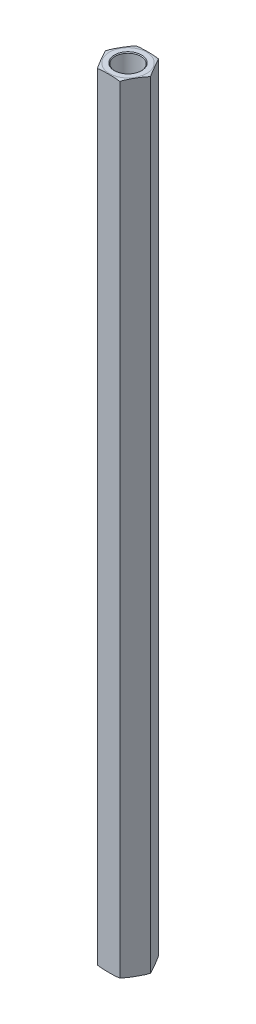
ISO-10303-21;
HEADER;
FILE_DESCRIPTION(('STEP AP214'),'2;1');
FILE_NAME('part.step','',(''),(''),'','','');
FILE_SCHEMA(('AUTOMOTIVE_DESIGN { 1 0 10303 214 1 1 1 1 }'));
ENDSEC;
DATA;
#1=APPLICATION_CONTEXT('core data for automotive mechanical design processes');
#2=APPLICATION_PROTOCOL_DEFINITION('international standard','automotive_design',2000,#1);
#3=PRODUCT_CONTEXT('',#1,'mechanical');
#4=PRODUCT('Part','Part','',(#3));
#5=PRODUCT_RELATED_PRODUCT_CATEGORY('part','',(#4));
#6=PRODUCT_DEFINITION_FORMATION('','',#4);
#7=PRODUCT_DEFINITION_CONTEXT('part definition',#1,'design');
#8=PRODUCT_DEFINITION('design','',#6,#7);
#9=PRODUCT_DEFINITION_SHAPE('','',#8);
#10=(LENGTH_UNIT() NAMED_UNIT(*) SI_UNIT(.MILLI.,.METRE.));
#11=(NAMED_UNIT(*) PLANE_ANGLE_UNIT() SI_UNIT($,.RADIAN.));
#12=(NAMED_UNIT(*) SI_UNIT($,.STERADIAN.) SOLID_ANGLE_UNIT());
#13=UNCERTAINTY_MEASURE_WITH_UNIT(LENGTH_MEASURE(1.E-05),#10,'distance_accuracy_value','');
#14=(GEOMETRIC_REPRESENTATION_CONTEXT(3) GLOBAL_UNCERTAINTY_ASSIGNED_CONTEXT((#13)) GLOBAL_UNIT_ASSIGNED_CONTEXT((#10,
#11,#12)) REPRESENTATION_CONTEXT('',''));
#15=CARTESIAN_POINT('',(0.,0.,0.));
#16=DIRECTION('',(0.,0.,1.));
#17=DIRECTION('',(1.,0.,0.));
#18=AXIS2_PLACEMENT_3D('',#15,#16,#17);
#19=CARTESIAN_POINT('',(0.,50.8,0.));
#20=DIRECTION('',(0.,1.,0.));
#21=DIRECTION('',(0.,0.,1.));
#22=AXIS2_PLACEMENT_3D('',#19,#20,#21);
#23=PLANE('',#22);
#24=CARTESIAN_POINT('',(0.,50.8,0.));
#25=DIRECTION('',(0.,1.,0.));
#26=DIRECTION('',(0.,0.,1.));
#27=AXIS2_PLACEMENT_3D('',#24,#25,#26);
#28=CIRCLE('',#27,2.0955);
#29=CARTESIAN_POINT('',(0.,50.8,2.0955));
#30=VERTEX_POINT('',#29);
#31=EDGE_CURVE('E302',#30,#30,#28,.T.);
#32=ORIENTED_EDGE('',*,*,#31,.T.);
#33=EDGE_LOOP('',(#32));
#34=FACE_BOUND('',#33,.T.);
#35=ADVANCED_FACE('F16',(#34),#23,.T.);
#36=CARTESIAN_POINT('',(0.,-50.8,0.));
#37=DIRECTION('',(0.,-1.,0.));
#38=DIRECTION('',(0.,0.,-1.));
#39=AXIS2_PLACEMENT_3D('',#36,#37,#38);
#40=PLANE('',#39);
#41=CARTESIAN_POINT('',(0.,-50.8,0.));
#42=DIRECTION('',(0.,-1.,0.));
#43=DIRECTION('',(0.,0.,-1.));
#44=AXIS2_PLACEMENT_3D('',#41,#42,#43);
#45=CIRCLE('',#44,2.0955);
#46=CARTESIAN_POINT('',(0.,-50.8,-2.0955));
#47=VERTEX_POINT('',#46);
#48=EDGE_CURVE('E415',#47,#47,#45,.T.);
#49=ORIENTED_EDGE('',*,*,#48,.T.);
#50=EDGE_LOOP('',(#49));
#51=FACE_BOUND('',#50,.T.);
#52=ADVANCED_FACE('F397',(#51),#40,.T.);
#53=CARTESIAN_POINT('',(0.,50.8,0.));
#54=DIRECTION('',(0.,1.,0.));
#55=DIRECTION('',(0.,0.,1.));
#56=AXIS2_PLACEMENT_3D('',#53,#54,#55);
#57=CYLINDRICAL_SURFACE('',#56,2.0955);
#58=CARTESIAN_POINT('',(0.,63.3729999999559,0.));
#59=DIRECTION('',(0.,1.,0.));
#60=DIRECTION('',(0.,0.,1.));
#61=AXIS2_PLACEMENT_3D('',#58,#59,#60);
#62=CIRCLE('',#61,2.09549999993897);
#63=CARTESIAN_POINT('',(0.,63.3729999999559,2.09549999993897));
#64=VERTEX_POINT('',#63);
#65=EDGE_CURVE('E417',#64,#64,#62,.T.);
#66=ORIENTED_EDGE('',*,*,#65,.T.);
#67=EDGE_LOOP('',(#66));
#68=FACE_BOUND('',#67,.T.);
#69=ORIENTED_EDGE('',*,*,#31,.F.);
#70=EDGE_LOOP('',(#69));
#71=FACE_BOUND('',#70,.T.);
#72=ADVANCED_FACE('F389',(#68,#71),#57,.F.);
#73=CARTESIAN_POINT('',(0.,-50.8,0.));
#74=DIRECTION('',(0.,-1.,0.));
#75=DIRECTION('',(0.,0.,-1.));
#76=AXIS2_PLACEMENT_3D('',#73,#74,#75);
#77=CYLINDRICAL_SURFACE('',#76,2.0955);
#78=ORIENTED_EDGE('',*,*,#48,.F.);
#79=EDGE_LOOP('',(#78));
#80=FACE_BOUND('',#79,.T.);
#81=CARTESIAN_POINT('',(0.,-63.3730000000128,0.));
#82=DIRECTION('',(0.,-1.,0.));
#83=DIRECTION('',(0.,0.,-1.));
#84=AXIS2_PLACEMENT_3D('',#81,#82,#83);
#85=CIRCLE('',#84,2.09550000005265);
#86=CARTESIAN_POINT('',(0.,-63.3730000000128,-2.09550000005265));
#87=VERTEX_POINT('',#86);
#88=EDGE_CURVE('E155',#87,#87,#85,.T.);
#89=ORIENTED_EDGE('',*,*,#88,.T.);
#90=EDGE_LOOP('',(#89));
#91=FACE_BOUND('',#90,.T.);
#92=ADVANCED_FACE('F381',(#80,#91),#77,.F.);
#93=CARTESIAN_POINT('',(0.,63.4999999999764,0.));
#94=DIRECTION('',(0.,1.,0.));
#95=DIRECTION('',(0.,0.,1.));
#96=AXIS2_PLACEMENT_3D('',#93,#94,#95);
#97=CONICAL_SURFACE('',#96,2.22249999995938,0.785398163397448);
#98=CARTESIAN_POINT('',(0.,63.5000000000332,0.));
#99=DIRECTION('',(0.,1.,0.));
#100=DIRECTION('',(0.,0.,1.));
#101=AXIS2_PLACEMENT_3D('',#98,#99,#100);
#102=CIRCLE('',#101,2.22250000001623);
#103=CARTESIAN_POINT('',(0.,63.5000000000332,2.22250000001623));
#104=VERTEX_POINT('',#103);
#105=EDGE_CURVE('E299',#104,#104,#102,.T.);
#106=ORIENTED_EDGE('',*,*,#105,.T.);
#107=EDGE_LOOP('',(#106));
#108=FACE_BOUND('',#107,.T.);
#109=ORIENTED_EDGE('',*,*,#65,.F.);
#110=EDGE_LOOP('',(#109));
#111=FACE_BOUND('',#110,.T.);
#112=ADVANCED_FACE('F322',(#108,#111),#97,.F.);
#113=CARTESIAN_POINT('',(3.66617420935412,63.5,0.));
#114=DIRECTION('',(-0.866025403784439,0.,0.5));
#115=DIRECTION('',(0.5,0.,0.866025403784439));
#116=AXIS2_PLACEMENT_3D('',#113,#114,#115);
#117=PLANE('',#116);
#118=DIRECTION('',(0.,1.,0.));
#119=VECTOR('',#118,1.);
#120=CARTESIAN_POINT('',(1.83308710467706,63.5,-3.175));
#121=LINE('',#120,#119);
#122=CARTESIAN_POINT('',(1.83308710467706,-63.373,-3.175));
#123=VERTEX_POINT('',#122);
#124=CARTESIAN_POINT('',(1.83308710467706,63.373,-3.175));
#125=VERTEX_POINT('',#124);
#126=EDGE_CURVE('E78',#123,#125,#121,.T.);
#127=ORIENTED_EDGE('',*,*,#126,.T.);
#128=CARTESIAN_POINT('',(3.66617420935412,63.373,0.));
#129=CARTESIAN_POINT('',(3.62797961467394,63.3889014148997,-0.0661549785605575));
#130=CARTESIAN_POINT('',(3.58956810864157,63.4024886076105,-0.132685658603875));
#131=CARTESIAN_POINT('',(3.51249051795711,63.4258161979402,-0.266187961794358));
#132=CARTESIAN_POINT('',(3.47382473049846,63.4355604771397,-0.333159070187389));
#133=CARTESIAN_POINT('',(3.39641631867873,63.4519966530451,-0.46723437239238));
#134=CARTESIAN_POINT('',(3.35767399633312,63.4586945328669,-0.534338043098183));
#135=CARTESIAN_POINT('',(3.28009834620113,63.4697767572932,-0.66870301055698));
#136=CARTESIAN_POINT('',(3.24126499587771,63.474160450474,-0.735964346345267));
#137=CARTESIAN_POINT('',(3.16354065964315,63.4812403004263,-0.870586845688097));
#138=CARTESIAN_POINT('',(3.12464965374476,63.4839355237591,-0.937948043861568));
#139=CARTESIAN_POINT('',(3.04685144594593,63.4881531983714,-1.07269849250694));
#140=CARTESIAN_POINT('',(3.00794424351969,63.4896756080272,-1.14008774388955));
#141=CARTESIAN_POINT('',(2.93051517598873,63.491922705889,-1.27419882283586));
#142=CARTESIAN_POINT('',(2.89199336248934,63.4926552468181,-1.34092056101649));
#143=CARTESIAN_POINT('',(2.81494778346144,63.4935767302574,-1.47436741839139));
#144=CARTESIAN_POINT('',(2.77642401791439,63.4937656658949,-1.54109253761774));
#145=CARTESIAN_POINT('',(2.69935964431012,63.4936659966806,-1.6745719481538));
#146=CARTESIAN_POINT('',(2.66081903631821,63.4933771811766,-1.74132623935039));
#147=CARTESIAN_POINT('',(2.5837390808533,63.492221986219,-1.87483263846077));
#148=CARTESIAN_POINT('',(2.54519973341245,63.4913555970386,-1.94158474631886));
#149=CARTESIAN_POINT('',(2.46812969629771,63.4887861940656,-2.07507396634282));
#150=CARTESIAN_POINT('',(2.42959900625965,63.4870832271616,-2.14181107913942));
#151=CARTESIAN_POINT('',(2.35255651340908,63.4824387229726,-2.27525259109836));
#152=CARTESIAN_POINT('',(2.31404470975443,63.4794972471358,-2.34195699171935));
#153=CARTESIAN_POINT('',(2.25084206239945,63.4732174124749,-2.45142718811103));
#154=CARTESIAN_POINT('',(2.2261384933701,63.4703980110463,-2.49421502479815));
#155=CARTESIAN_POINT('',(2.17676945272228,63.4638696794304,-2.57972471152111));
#156=CARTESIAN_POINT('',(2.15210397034183,63.4601610809139,-2.62244658019723));
#157=CARTESIAN_POINT('',(2.10282753811696,63.4516802711497,-2.70779586442644));
#158=CARTESIAN_POINT('',(2.07821657107529,63.4469084657008,-2.75042330976602));
#159=CARTESIAN_POINT('',(2.02900094683549,63.4360987712516,-2.83566727147556));
#160=CARTESIAN_POINT('',(2.00439646085463,63.4300577313084,-2.87828349128853));
#161=CARTESIAN_POINT('',(1.95527325900933,63.4165138354161,-2.96336737271505));
#162=CARTESIAN_POINT('',(1.93075459617614,63.409010197803,-3.00583494247579));
#163=CARTESIAN_POINT('',(1.88182157373171,63.3923203507084,-3.09058942351745));
#164=CARTESIAN_POINT('',(1.85740744053269,63.3831314978033,-3.1328759426409));
#165=CARTESIAN_POINT('',(1.83308710467706,63.373,-3.175));
#166=B_SPLINE_CURVE_WITH_KNOTS('',3,(#128,#129,#130,#131,#132,#133,#134,#135,#136,#137,#138,
#139,#140,#141,#142,#143,#144,#145,#146,#147,#148,#149,#150,#151,#152,#153,#154,#155,#156,#157,
#158,#159,#160,#161,#162,#163,#164,#165),.UNSPECIFIED.,.F.,.F.,(4,2,2,2,2,2,2,2,2,2,2,2,2,2,2,2,
2,2,4),(0.,0.233977307817942,0.467717675040691,0.700996973557496,0.934341903229746,
1.16781571967239,1.40129782179824,1.63243665809669,1.86357841666616,2.09482211846293,
2.32606971471494,2.55730435147396,2.78852751694412,2.93698369265086,3.08538458004473,
3.23372892334584,3.38244598546612,3.53124274626084,3.68027493713585),.UNSPECIFIED.);
#167=CARTESIAN_POINT('',(3.66617420935412,63.373,0.));
#168=VERTEX_POINT('',#167);
#169=EDGE_CURVE('E71',#168,#125,#166,.T.);
#170=ORIENTED_EDGE('',*,*,#169,.F.);
#171=DIRECTION('',(0.,1.,0.));
#172=VECTOR('',#171,1.);
#173=CARTESIAN_POINT('',(3.66617420935412,63.5,0.));
#174=LINE('',#173,#172);
#175=CARTESIAN_POINT('',(3.66617420935412,-63.373,0.));
#176=VERTEX_POINT('',#175);
#177=EDGE_CURVE('E75',#168,#176,#174,.F.);
#178=ORIENTED_EDGE('',*,*,#177,.T.);
#179=CARTESIAN_POINT('',(1.83308710467706,-63.373,-3.17499999999999));
#180=CARTESIAN_POINT('',(1.87128169935724,-63.3889014148997,-3.10884502143943));
#181=CARTESIAN_POINT('',(1.90969320538961,-63.4024886076105,-3.04231434139611));
#182=CARTESIAN_POINT('',(1.98677079607407,-63.4258161979402,-2.90881203820563));
#183=CARTESIAN_POINT('',(2.02543658353272,-63.4355604771397,-2.8418409298126));
#184=CARTESIAN_POINT('',(2.10284499535245,-63.4519966530451,-2.70776562760761));
#185=CARTESIAN_POINT('',(2.14158731769806,-63.4586945328669,-2.6406619569018));
#186=CARTESIAN_POINT('',(2.21916296783005,-63.4697767572932,-2.50629698944301));
#187=CARTESIAN_POINT('',(2.25799631815347,-63.474160450474,-2.43903565365472));
#188=CARTESIAN_POINT('',(2.33572065438804,-63.4812403004263,-2.30441315431189));
#189=CARTESIAN_POINT('',(2.37461166028642,-63.4839355237591,-2.23705195613842));
#190=CARTESIAN_POINT('',(2.45240986808526,-63.4881531983714,-2.10230150749304));
#191=CARTESIAN_POINT('',(2.49131707051149,-63.4896756080272,-2.03491225611043));
#192=CARTESIAN_POINT('',(2.56874613804245,-63.491922705889,-1.90080117716413));
#193=CARTESIAN_POINT('',(2.60726795154184,-63.4926552468181,-1.8340794389835));
#194=CARTESIAN_POINT('',(2.68431353056975,-63.4935767302574,-1.70063258160859));
#195=CARTESIAN_POINT('',(2.72283729611679,-63.4937656658949,-1.63390746238224));
#196=CARTESIAN_POINT('',(2.79990166972106,-63.4936659966806,-1.50042805184618));
#197=CARTESIAN_POINT('',(2.83844227771297,-63.4933771811766,-1.4336737606496));
#198=CARTESIAN_POINT('',(2.91552223317789,-63.492221986219,-1.30016736153921));
#199=CARTESIAN_POINT('',(2.95406158061873,-63.4913555970386,-1.23341525368112));
#200=CARTESIAN_POINT('',(3.03113161773348,-63.4887861940656,-1.09992603365716));
#201=CARTESIAN_POINT('',(3.06966230777154,-63.4870832271616,-1.03318892086056));
#202=CARTESIAN_POINT('',(3.1467048006221,-63.4824387229726,-0.899747408901616));
#203=CARTESIAN_POINT('',(3.18521660427676,-63.4794972471358,-0.833043008280631));
#204=CARTESIAN_POINT('',(3.24841925163174,-63.4732174124749,-0.723572811888948));
#205=CARTESIAN_POINT('',(3.27312282066109,-63.4703980110463,-0.680784975201834));
#206=CARTESIAN_POINT('',(3.32249186130891,-63.4638696794304,-0.595275288478877));
#207=CARTESIAN_POINT('',(3.34715734368935,-63.4601610809139,-0.552553419802754));
#208=CARTESIAN_POINT('',(3.39643377591422,-63.4516802711497,-0.467204135573548));
#209=CARTESIAN_POINT('',(3.42104474295589,-63.4469084657008,-0.424576690233975));
#210=CARTESIAN_POINT('',(3.47026036719568,-63.4360987712516,-0.339332728524437));
#211=CARTESIAN_POINT('',(3.49486485317655,-63.4300577313084,-0.296716508711467));
#212=CARTESIAN_POINT('',(3.54398805502185,-63.4165138354161,-0.211632627284948));
#213=CARTESIAN_POINT('',(3.56850671785504,-63.409010197803,-0.169165057524209));
#214=CARTESIAN_POINT('',(3.61743974029946,-63.3923203507084,-0.0844105764825525));
#215=CARTESIAN_POINT('',(3.64185387349848,-63.3831314978033,-0.0421240573591055));
#216=CARTESIAN_POINT('',(3.66617420935411,-63.373,0.));
#217=B_SPLINE_CURVE_WITH_KNOTS('',3,(#179,#180,#181,#182,#183,#184,#185,#186,#187,#188,#189,
#190,#191,#192,#193,#194,#195,#196,#197,#198,#199,#200,#201,#202,#203,#204,#205,#206,#207,#208,
#209,#210,#211,#212,#213,#214,#215,#216),.UNSPECIFIED.,.F.,.F.,(4,2,2,2,2,2,2,2,2,2,2,2,2,2,2,2,
2,2,4),(0.,0.233977307817943,0.467717675040694,0.7009969735575,0.934341903229751,
1.1678157196724,1.40129782179824,1.6324366580967,1.86357841666617,2.09482211846294,
2.32606971471495,2.55730435147398,2.78852751694413,2.93698369265087,3.08538458004473,
3.23372892334584,3.38244598546612,3.53124274626083,3.68027493713583),.UNSPECIFIED.);
#218=EDGE_CURVE('E89',#123,#176,#217,.T.);
#219=ORIENTED_EDGE('',*,*,#218,.F.);
#220=EDGE_LOOP('',(#127,#170,#178,#219));
#221=FACE_BOUND('',#220,.T.);
#222=ADVANCED_FACE('F73',(#221),#117,.F.);
#223=CARTESIAN_POINT('',(0.,-63.4999999999195,0.));
#224=DIRECTION('',(0.,-1.,0.));
#225=DIRECTION('',(0.,0.,-1.));
#226=AXIS2_PLACEMENT_3D('',#223,#224,#225);
#227=CONICAL_SURFACE('',#226,2.22249999995938,0.785398163397448);
#228=ORIENTED_EDGE('',*,*,#88,.F.);
#229=EDGE_LOOP('',(#228));
#230=FACE_BOUND('',#229,.T.);
#231=CARTESIAN_POINT('',(0.,-63.4999999999764,0.));
#232=DIRECTION('',(0.,-1.,0.));
#233=DIRECTION('',(0.,0.,-1.));
#234=AXIS2_PLACEMENT_3D('',#231,#232,#233);
#235=CIRCLE('',#234,2.22250000001623);
#236=CARTESIAN_POINT('',(0.,-63.4999999999764,-2.22250000001623));
#237=VERTEX_POINT('',#236);
#238=EDGE_CURVE('E279',#237,#237,#235,.F.);
#239=ORIENTED_EDGE('',*,*,#238,.F.);
#240=EDGE_LOOP('',(#239));
#241=FACE_BOUND('',#240,.T.);
#242=ADVANCED_FACE('F314',(#230,#241),#227,.F.);
#243=CARTESIAN_POINT('',(-1.83308710467707,63.5,-3.175));
#244=DIRECTION('',(0.,-1.,0.));
#245=DIRECTION('',(0.,0.,-1.));
#246=AXIS2_PLACEMENT_3D('',#243,#244,#245);
#247=PLANE('',#246);
#248=CARTESIAN_POINT('',(0.,63.5,0.));
#249=DIRECTION('',(0.,-1.,0.));
#250=DIRECTION('',(0.,0.,1.));
#251=AXIS2_PLACEMENT_3D('',#248,#249,#250);
#252=CIRCLE('',#251,3.03117420935412);
#253=CARTESIAN_POINT('',(0.,63.5,3.03117420935412));
#254=VERTEX_POINT('',#253);
#255=CARTESIAN_POINT('',(0.,63.5,-3.03117420935412));
#256=VERTEX_POINT('',#255);
#257=EDGE_CURVE('E131',#254,#256,#252,.T.);
#258=ORIENTED_EDGE('',*,*,#257,.F.);
#259=CARTESIAN_POINT('',(0.,63.5,0.));
#260=DIRECTION('',(0.,-1.,0.));
#261=DIRECTION('',(0.,0.,-1.));
#262=AXIS2_PLACEMENT_3D('',#259,#260,#261);
#263=CIRCLE('',#262,3.03117420935412);
#264=EDGE_CURVE('E82',#256,#254,#263,.T.);
#265=ORIENTED_EDGE('',*,*,#264,.F.);
#266=EDGE_LOOP('',(#258,#265));
#267=FACE_BOUND('',#266,.T.);
#268=ORIENTED_EDGE('',*,*,#105,.F.);
#269=EDGE_LOOP('',(#268));
#270=FACE_BOUND('',#269,.T.);
#271=ADVANCED_FACE('F117',(#267,#270),#247,.F.);
#272=CARTESIAN_POINT('',(1.83308710467706,63.5,3.17499999999999));
#273=DIRECTION('',(-0.866025403784439,0.,-0.5));
#274=DIRECTION('',(-0.5,0.,0.866025403784439));
#275=AXIS2_PLACEMENT_3D('',#272,#273,#274);
#276=PLANE('',#275);
#277=ORIENTED_EDGE('',*,*,#177,.F.);
#278=CARTESIAN_POINT('',(1.83308710467706,63.373,3.17499999999999));
#279=CARTESIAN_POINT('',(1.87128169935724,63.3889014148997,3.10884502143944));
#280=CARTESIAN_POINT('',(1.90969320538961,63.4024886076105,3.04231434139612));
#281=CARTESIAN_POINT('',(1.98677079607407,63.4258161979402,2.90881203820563));
#282=CARTESIAN_POINT('',(2.02543658353272,63.4355604771397,2.8418409298126));
#283=CARTESIAN_POINT('',(2.10284499535245,63.4519966530451,2.70776562760761));
#284=CARTESIAN_POINT('',(2.14158731769806,63.4586945328669,2.64066195690181));
#285=CARTESIAN_POINT('',(2.21916296783005,63.4697767572932,2.50629698944301));
#286=CARTESIAN_POINT('',(2.25799631815347,63.474160450474,2.43903565365473));
#287=CARTESIAN_POINT('',(2.33572065438803,63.4812403004263,2.3044131543119));
#288=CARTESIAN_POINT('',(2.37461166028642,63.4839355237591,2.23705195613843));
#289=CARTESIAN_POINT('',(2.45240986808525,63.4881531983714,2.10230150749305));
#290=CARTESIAN_POINT('',(2.49131707051149,63.4896756080272,2.03491225611044));
#291=CARTESIAN_POINT('',(2.56874613804245,63.491922705889,1.90080117716414));
#292=CARTESIAN_POINT('',(2.60726795154184,63.4926552468181,1.83407943898351));
#293=CARTESIAN_POINT('',(2.68431353056974,63.4935767302574,1.7006325816086));
#294=CARTESIAN_POINT('',(2.72283729611679,63.4937656658949,1.63390746238225));
#295=CARTESIAN_POINT('',(2.79990166972106,63.4936659966806,1.50042805184619));
#296=CARTESIAN_POINT('',(2.83844227771297,63.4933771811766,1.43367376064961));
#297=CARTESIAN_POINT('',(2.91552223317788,63.492221986219,1.30016736153923));
#298=CARTESIAN_POINT('',(2.95406158061873,63.4913555970386,1.23341525368113));
#299=CARTESIAN_POINT('',(3.03113161773347,63.4887861940656,1.09992603365717));
#300=CARTESIAN_POINT('',(3.06966230777153,63.4870832271616,1.03318892086057));
#301=CARTESIAN_POINT('',(3.1467048006221,63.4824387229726,0.89974740890163));
#302=CARTESIAN_POINT('',(3.18521660427676,63.4794972471358,0.833043008280645));
#303=CARTESIAN_POINT('',(3.24841925163173,63.4732174124749,0.723572811888962));
#304=CARTESIAN_POINT('',(3.27312282066108,63.4703980110463,0.680784975201847));
#305=CARTESIAN_POINT('',(3.3224918613089,63.4638696794304,0.595275288478887));
#306=CARTESIAN_POINT('',(3.34715734368935,63.4601610809139,0.552553419802764));
#307=CARTESIAN_POINT('',(3.39643377591422,63.4516802711497,0.467204135573556));
#308=CARTESIAN_POINT('',(3.42104474295589,63.4469084657008,0.424576690233982));
#309=CARTESIAN_POINT('',(3.47026036719568,63.4360987712516,0.339332728524442));
#310=CARTESIAN_POINT('',(3.49486485317655,63.4300577313084,0.296716508711471));
#311=CARTESIAN_POINT('',(3.54398805502185,63.4165138354161,0.211632627284951));
#312=CARTESIAN_POINT('',(3.56850671785504,63.409010197803,0.169165057524211));
#313=CARTESIAN_POINT('',(3.61743974029947,63.3923203507084,0.0844105764825526));
#314=CARTESIAN_POINT('',(3.64185387349848,63.3831314978033,0.0421240573591046));
#315=CARTESIAN_POINT('',(3.66617420935412,63.373,0.));
#316=B_SPLINE_CURVE_WITH_KNOTS('',3,(#278,#279,#280,#281,#282,#283,#284,#285,#286,#287,#288,
#289,#290,#291,#292,#293,#294,#295,#296,#297,#298,#299,#300,#301,#302,#303,#304,#305,#306,#307,
#308,#309,#310,#311,#312,#313,#314,#315),.UNSPECIFIED.,.F.,.F.,(4,2,2,2,2,2,2,2,2,2,2,2,2,2,2,2,
2,2,4),(0.,0.233977307817942,0.467717675040691,0.700996973557496,0.934341903229745,
1.16781571967239,1.40129782179824,1.63243665809669,1.86357841666616,2.09482211846293,
2.32606971471494,2.55730435147396,2.78852751694412,2.93698369265086,3.08538458004472,
3.23372892334583,3.38244598546612,3.53124274626083,3.68027493713584),.UNSPECIFIED.);
#317=CARTESIAN_POINT('',(1.83308710467706,63.373,3.17499999999999));
#318=VERTEX_POINT('',#317);
#319=EDGE_CURVE('E81',#318,#168,#316,.T.);
#320=ORIENTED_EDGE('',*,*,#319,.F.);
#321=DIRECTION('',(0.,1.,0.));
#322=VECTOR('',#321,1.);
#323=CARTESIAN_POINT('',(1.83308710467706,63.5,3.17499999999999));
#324=LINE('',#323,#322);
#325=CARTESIAN_POINT('',(1.83308710467706,-63.373,3.17499999999999));
#326=VERTEX_POINT('',#325);
#327=EDGE_CURVE('E178',#318,#326,#324,.F.);
#328=ORIENTED_EDGE('',*,*,#327,.T.);
#329=CARTESIAN_POINT('',(3.66617420935412,-63.373,0.));
#330=CARTESIAN_POINT('',(3.62797961467394,-63.3889014148997,0.0661549785605648));
#331=CARTESIAN_POINT('',(3.58956810864156,-63.4024886076105,0.132685658603882));
#332=CARTESIAN_POINT('',(3.5124905179571,-63.4258161979402,0.266187961794366));
#333=CARTESIAN_POINT('',(3.47382473049846,-63.4355604771397,0.333159070187397));
#334=CARTESIAN_POINT('',(3.39641631867873,-63.4519966530451,0.467234372392389));
#335=CARTESIAN_POINT('',(3.35767399633312,-63.4586945328669,0.534338043098192));
#336=CARTESIAN_POINT('',(3.28009834620113,-63.4697767572932,0.668703010556991));
#337=CARTESIAN_POINT('',(3.24126499587771,-63.474160450474,0.735964346345278));
#338=CARTESIAN_POINT('',(3.16354065964314,-63.4812403004263,0.870586845688109));
#339=CARTESIAN_POINT('',(3.12464965374475,-63.4839355237591,0.93794804386158));
#340=CARTESIAN_POINT('',(3.04685144594592,-63.4881531983714,1.07269849250696));
#341=CARTESIAN_POINT('',(3.00794424351969,-63.4896756080272,1.14008774388956));
#342=CARTESIAN_POINT('',(2.93051517598872,-63.491922705889,1.27419882283587));
#343=CARTESIAN_POINT('',(2.89199336248934,-63.4926552468181,1.3409205610165));
#344=CARTESIAN_POINT('',(2.81494778346143,-63.4935767302574,1.47436741839141));
#345=CARTESIAN_POINT('',(2.77642401791438,-63.4937656658949,1.54109253761776));
#346=CARTESIAN_POINT('',(2.69935964431012,-63.4936659966806,1.67457194815382));
#347=CARTESIAN_POINT('',(2.66081903631821,-63.4933771811766,1.7413262393504));
#348=CARTESIAN_POINT('',(2.58373908085329,-63.492221986219,1.87483263846079));
#349=CARTESIAN_POINT('',(2.54519973341244,-63.4913555970386,1.94158474631888));
#350=CARTESIAN_POINT('',(2.4681296962977,-63.4887861940656,2.07507396634284));
#351=CARTESIAN_POINT('',(2.42959900625964,-63.4870832271616,2.14181107913944));
#352=CARTESIAN_POINT('',(2.35255651340907,-63.4824387229726,2.27525259109838));
#353=CARTESIAN_POINT('',(2.31404470975442,-63.4794972471358,2.34195699171937));
#354=CARTESIAN_POINT('',(2.25084206239944,-63.4732174124749,2.45142718811105));
#355=CARTESIAN_POINT('',(2.22613849337009,-63.4703980110463,2.49421502479817));
#356=CARTESIAN_POINT('',(2.17676945272227,-63.4638696794304,2.57972471152112));
#357=CARTESIAN_POINT('',(2.15210397034183,-63.4601610809139,2.62244658019725));
#358=CARTESIAN_POINT('',(2.10282753811695,-63.4516802711497,2.70779586442645));
#359=CARTESIAN_POINT('',(2.07821657107529,-63.4469084657008,2.75042330976602));
#360=CARTESIAN_POINT('',(2.02900094683549,-63.4360987712516,2.83566727147556));
#361=CARTESIAN_POINT('',(2.00439646085463,-63.4300577313084,2.87828349128853));
#362=CARTESIAN_POINT('',(1.95527325900933,-63.4165138354161,2.96336737271505));
#363=CARTESIAN_POINT('',(1.93075459617614,-63.409010197803,3.00583494247579));
#364=CARTESIAN_POINT('',(1.88182157373171,-63.3923203507084,3.09058942351744));
#365=CARTESIAN_POINT('',(1.8574074405327,-63.3831314978033,3.13287594264089));
#366=CARTESIAN_POINT('',(1.83308710467706,-63.373,3.17499999999999));
#367=B_SPLINE_CURVE_WITH_KNOTS('',3,(#329,#330,#331,#332,#333,#334,#335,#336,#337,#338,#339,
#340,#341,#342,#343,#344,#345,#346,#347,#348,#349,#350,#351,#352,#353,#354,#355,#356,#357,#358,
#359,#360,#361,#362,#363,#364,#365,#366),.UNSPECIFIED.,.F.,.F.,(4,2,2,2,2,2,2,2,2,2,2,2,2,2,2,2,
2,2,4),(0.,0.233977307817943,0.467717675040693,0.7009969735575,0.934341903229751,
1.1678157196724,1.40129782179825,1.6324366580967,1.86357841666617,2.09482211846294,
2.32606971471495,2.55730435147398,2.78852751694413,2.93698369265087,3.08538458004473,
3.23372892334584,3.38244598546612,3.53124274626083,3.68027493713583),.UNSPECIFIED.);
#368=EDGE_CURVE('E88',#176,#326,#367,.T.);
#369=ORIENTED_EDGE('',*,*,#368,.F.);
#370=EDGE_LOOP('',(#277,#320,#328,#369));
#371=FACE_BOUND('',#370,.T.);
#372=ADVANCED_FACE('F85',(#371),#276,.F.);
#373=CARTESIAN_POINT('',(1.83308710467706,63.5,-3.175));
#374=DIRECTION('',(0.,0.,1.));
#375=DIRECTION('',(1.,0.,0.));
#376=AXIS2_PLACEMENT_3D('',#373,#374,#375);
#377=PLANE('',#376);
#378=DIRECTION('',(0.,1.,0.));
#379=VECTOR('',#378,1.);
#380=CARTESIAN_POINT('',(-1.83308710467708,63.5,-3.17499999999998));
#381=LINE('',#380,#379);
#382=CARTESIAN_POINT('',(-1.83308710467708,-63.373,-3.17499999999998));
#383=VERTEX_POINT('',#382);
#384=CARTESIAN_POINT('',(-1.83308710467706,63.373,-3.17500000000001));
#385=VERTEX_POINT('',#384);
#386=EDGE_CURVE('E180',#383,#385,#381,.T.);
#387=ORIENTED_EDGE('',*,*,#386,.T.);
#388=CARTESIAN_POINT('',(1.83308710467706,63.373,-3.17500000000001));
#389=CARTESIAN_POINT('',(1.73237579828683,63.3939400141518,-3.175));
#390=CARTESIAN_POINT('',(1.63096506893486,63.4108853495327,-3.175));
#391=CARTESIAN_POINT('',(1.42767146651469,63.4384971643984,-3.175));
#392=CARTESIAN_POINT('',(1.32579191427254,63.4491875658753,-3.175));
#393=CARTESIAN_POINT('',(1.12177634709138,63.4661280408079,-3.175));
#394=CARTESIAN_POINT('',(1.0196405664338,63.4723812707189,-3.175));
#395=CARTESIAN_POINT('',(0.815663681397375,63.4819028064183,-3.175));
#396=CARTESIAN_POINT('',(0.713823115514573,63.4851834044999,-3.175));
#397=CARTESIAN_POINT('',(0.510018485441651,63.4899454848703,-3.175));
#398=CARTESIAN_POINT('',(0.408054390577976,63.4914254100882,-3.175));
#399=CARTESIAN_POINT('',(0.20406020033787,63.4933146818379,-3.175));
#400=CARTESIAN_POINT('',(0.102030100168935,63.4937234241492,-3.175));
#401=CARTESIAN_POINT('',(-0.102030100168934,63.4937234241492,-3.175));
#402=CARTESIAN_POINT('',(-0.204060200337869,63.4933146818379,-3.175));
#403=CARTESIAN_POINT('',(-0.408054390577975,63.4914254100882,-3.175));
#404=CARTESIAN_POINT('',(-0.510018485441649,63.4899454848703,-3.175));
#405=CARTESIAN_POINT('',(-0.713823115514571,63.4851834044999,-3.175));
#406=CARTESIAN_POINT('',(-0.815663681397373,63.4819028064183,-3.175));
#407=CARTESIAN_POINT('',(-1.01964056643379,63.4723812707189,-3.175));
#408=CARTESIAN_POINT('',(-1.12177634709137,63.4661280408079,-3.175));
#409=CARTESIAN_POINT('',(-1.32579191427254,63.4491875658753,-3.175));
#410=CARTESIAN_POINT('',(-1.42767146651469,63.4384971643984,-3.175));
#411=CARTESIAN_POINT('',(-1.63096506893485,63.4108853495327,-3.175));
#412=CARTESIAN_POINT('',(-1.73237579828683,63.3939400141518,-3.175));
#413=CARTESIAN_POINT('',(-1.83308710467705,63.373,-3.175));
#414=B_SPLINE_CURVE_WITH_KNOTS('',3,(#388,#389,#390,#391,#392,#393,#394,#395,#396,#397,#398,
#399,#400,#401,#402,#403,#404,#405,#406,#407,#408,#409,#410,#411,#412,#413),.UNSPECIFIED.,.F.,
.F.,(4,2,2,2,2,2,2,2,2,2,2,2,4),(0.,0.308333242342807,0.615479423308233,0.922406891130008,
1.2280592962085,1.53397581645216,1.84006485747889,2.14615389850561,2.45207041874927,
2.75772282382776,3.06465029164954,3.37179647261496,3.68012971495777),.UNSPECIFIED.);
#415=EDGE_CURVE('E183',#125,#385,#414,.T.);
#416=ORIENTED_EDGE('',*,*,#415,.F.);
#417=ORIENTED_EDGE('',*,*,#126,.F.);
#418=CARTESIAN_POINT('',(-1.83308710467707,-63.373,-3.175));
#419=CARTESIAN_POINT('',(-1.73237579828684,-63.3939400141518,-3.175));
#420=CARTESIAN_POINT('',(-1.63096506893487,-63.4108853495327,-3.175));
#421=CARTESIAN_POINT('',(-1.4276714665147,-63.4384971643984,-3.175));
#422=CARTESIAN_POINT('',(-1.32579191427255,-63.4491875658753,-3.175));
#423=CARTESIAN_POINT('',(-1.12177634709138,-63.4661280408079,-3.175));
#424=CARTESIAN_POINT('',(-1.0196405664338,-63.4723812707189,-3.175));
#425=CARTESIAN_POINT('',(-0.81566368139738,-63.4819028064183,-3.175));
#426=CARTESIAN_POINT('',(-0.713823115514577,-63.4851834044999,-3.175));
#427=CARTESIAN_POINT('',(-0.510018485441654,-63.4899454848703,-3.175));
#428=CARTESIAN_POINT('',(-0.408054390577979,-63.4914254100882,-3.175));
#429=CARTESIAN_POINT('',(-0.204060200337872,-63.4933146818379,-3.175));
#430=CARTESIAN_POINT('',(-0.102030100168936,-63.4937234241492,-3.175));
#431=CARTESIAN_POINT('',(0.102030100168935,-63.4937234241492,-3.175));
#432=CARTESIAN_POINT('',(0.20406020033787,-63.4933146818379,-3.175));
#433=CARTESIAN_POINT('',(0.408054390577976,-63.4914254100882,-3.175));
#434=CARTESIAN_POINT('',(0.510018485441651,-63.4899454848703,-3.175));
#435=CARTESIAN_POINT('',(0.713823115514573,-63.4851834044999,-3.175));
#436=CARTESIAN_POINT('',(0.815663681397375,-63.4819028064183,-3.175));
#437=CARTESIAN_POINT('',(1.0196405664338,-63.4723812707189,-3.175));
#438=CARTESIAN_POINT('',(1.12177634709137,-63.4661280408079,-3.175));
#439=CARTESIAN_POINT('',(1.32579191427254,-63.4491875658753,-3.175));
#440=CARTESIAN_POINT('',(1.42767146651469,-63.4384971643984,-3.175));
#441=CARTESIAN_POINT('',(1.63096506893486,-63.4108853495327,-3.175));
#442=CARTESIAN_POINT('',(1.73237579828683,-63.3939400141518,-3.175));
#443=CARTESIAN_POINT('',(1.83308710467706,-63.373,-3.17500000000001));
#444=B_SPLINE_CURVE_WITH_KNOTS('',3,(#418,#419,#420,#421,#422,#423,#424,#425,#426,#427,#428,
#429,#430,#431,#432,#433,#434,#435,#436,#437,#438,#439,#440,#441,#442,#443),.UNSPECIFIED.,.F.,
.F.,(4,2,2,2,2,2,2,2,2,2,2,2,4),(0.,0.308333242342808,0.615479423308236,0.922406891130012,
1.22805929620851,1.53397581645217,1.8400648574789,2.14615389850562,2.45207041874928,
2.75772282382777,3.06465029164955,3.37179647261498,3.68012971495778),.UNSPECIFIED.);
#445=EDGE_CURVE('E262',#383,#123,#444,.T.);
#446=ORIENTED_EDGE('',*,*,#445,.F.);
#447=EDGE_LOOP('',(#387,#416,#417,#446));
#448=FACE_BOUND('',#447,.T.);
#449=ADVANCED_FACE('F205',(#448),#377,.F.);
#450=CARTESIAN_POINT('',(-1.83308710467707,-63.5,-3.175));
#451=DIRECTION('',(0.,-1.,0.));
#452=DIRECTION('',(0.,0.,-1.));
#453=AXIS2_PLACEMENT_3D('',#450,#451,#452);
#454=PLANE('',#453);
#455=CARTESIAN_POINT('',(0.,-63.5,0.));
#456=DIRECTION('',(0.,1.,0.));
#457=DIRECTION('',(0.,0.,1.));
#458=AXIS2_PLACEMENT_3D('',#455,#456,#457);
#459=CIRCLE('',#458,3.03117420935412);
#460=CARTESIAN_POINT('',(0.,-63.5,-3.03117420935412));
#461=VERTEX_POINT('',#460);
#462=CARTESIAN_POINT('',(0.,-63.5,3.03117420935412));
#463=VERTEX_POINT('',#462);
#464=EDGE_CURVE('E184',#461,#463,#459,.F.);
#465=ORIENTED_EDGE('',*,*,#464,.T.);
#466=CARTESIAN_POINT('',(0.,-63.5,0.));
#467=DIRECTION('',(0.,1.,0.));
#468=DIRECTION('',(0.,0.,-1.));
#469=AXIS2_PLACEMENT_3D('',#466,#467,#468);
#470=CIRCLE('',#469,3.03117420935412);
#471=EDGE_CURVE('E218',#461,#463,#470,.T.);
#472=ORIENTED_EDGE('',*,*,#471,.F.);
#473=EDGE_LOOP('',(#465,#472));
#474=FACE_BOUND('',#473,.T.);
#475=ORIENTED_EDGE('',*,*,#238,.T.);
#476=EDGE_LOOP('',(#475));
#477=FACE_BOUND('',#476,.T.);
#478=ADVANCED_FACE('F196',(#474,#477),#454,.T.);
#479=CARTESIAN_POINT('',(-1.83308710467707,63.5,-3.175));
#480=DIRECTION('',(0.866025403784439,0.,0.5));
#481=DIRECTION('',(0.5,0.,-0.866025403784439));
#482=AXIS2_PLACEMENT_3D('',#479,#480,#481);
#483=PLANE('',#482);
#484=DIRECTION('',(0.,1.,0.));
#485=VECTOR('',#484,1.);
#486=CARTESIAN_POINT('',(-3.66617420935413,63.5,0.));
#487=LINE('',#486,#485);
#488=CARTESIAN_POINT('',(-3.66617420935412,-63.373,0.));
#489=VERTEX_POINT('',#488);
#490=CARTESIAN_POINT('',(-3.66617420935412,63.373,0.));
#491=VERTEX_POINT('',#490);
#492=EDGE_CURVE('E238',#489,#491,#487,.T.);
#493=ORIENTED_EDGE('',*,*,#492,.T.);
#494=CARTESIAN_POINT('',(-1.83308710467706,63.373,-3.17500000000001));
#495=CARTESIAN_POINT('',(-1.87128169935723,63.3889014148997,-3.10884502143945));
#496=CARTESIAN_POINT('',(-1.90969320538961,63.4024886076105,-3.04231434139614));
#497=CARTESIAN_POINT('',(-1.98677079607407,63.4258161979402,-2.90881203820566));
#498=CARTESIAN_POINT('',(-2.02543658353271,63.4355604771397,-2.84184092981263));
#499=CARTESIAN_POINT('',(-2.10284499535244,63.4519966530451,-2.70776562760765));
#500=CARTESIAN_POINT('',(-2.14158731769805,63.4586945328669,-2.64066195690185));
#501=CARTESIAN_POINT('',(-2.21916296783003,63.4697767572932,-2.50629698944305));
#502=CARTESIAN_POINT('',(-2.25799631815345,63.474160450474,-2.43903565365477));
#503=CARTESIAN_POINT('',(-2.33572065438801,63.4812403004263,-2.30441315431194));
#504=CARTESIAN_POINT('',(-2.3746116602864,63.4839355237591,-2.23705195613847));
#505=CARTESIAN_POINT('',(-2.45240986808523,63.4881531983714,-2.1023015074931));
#506=CARTESIAN_POINT('',(-2.49131707051147,63.4896756080272,-2.0349122561105));
#507=CARTESIAN_POINT('',(-2.56874613804243,63.491922705889,-1.90080117716419));
#508=CARTESIAN_POINT('',(-2.60726795154181,63.4926552468181,-1.83407943898356));
#509=CARTESIAN_POINT('',(-2.68431353056972,63.4935767302574,-1.70063258160867));
#510=CARTESIAN_POINT('',(-2.72283729611676,63.4937656658949,-1.63390746238232));
#511=CARTESIAN_POINT('',(-2.79990166972103,63.4936659966806,-1.50042805184626));
#512=CARTESIAN_POINT('',(-2.83844227771293,63.4933771811766,-1.43367376064968));
#513=CARTESIAN_POINT('',(-2.91552223317785,63.492221986219,-1.3001673615393));
#514=CARTESIAN_POINT('',(-2.95406158061869,63.4913555970386,-1.23341525368121));
#515=CARTESIAN_POINT('',(-3.03113161773343,63.4887861940656,-1.09992603365726));
#516=CARTESIAN_POINT('',(-3.06966230777149,63.4870832271616,-1.03318892086066));
#517=CARTESIAN_POINT('',(-3.14670480062205,63.4824387229726,-0.899747408901719));
#518=CARTESIAN_POINT('',(-3.18521660427671,63.4794972471358,-0.833043008280736));
#519=CARTESIAN_POINT('',(-3.24841925163169,63.4732174124749,-0.723572811889049));
#520=CARTESIAN_POINT('',(-3.27312282066104,63.4703980110463,-0.680784975201928));
#521=CARTESIAN_POINT('',(-3.32249186130887,63.4638696794304,-0.595275288478958));
#522=CARTESIAN_POINT('',(-3.34715734368932,63.4601610809139,-0.552553419802829));
#523=CARTESIAN_POINT('',(-3.3964337759142,63.4516802711497,-0.46720413557361));
#524=CARTESIAN_POINT('',(-3.42104474295587,63.4469084657009,-0.42457669023403));
#525=CARTESIAN_POINT('',(-3.47026036719567,63.4360987712516,-0.339332728524479));
#526=CARTESIAN_POINT('',(-3.49486485317654,63.4300577313084,-0.296716508711504));
#527=CARTESIAN_POINT('',(-3.54398805502184,63.4165138354161,-0.211632627284973));
#528=CARTESIAN_POINT('',(-3.56850671785504,63.409010197803,-0.169165057524227));
#529=CARTESIAN_POINT('',(-3.61743974029947,63.3923203507084,-0.0844105764825576));
#530=CARTESIAN_POINT('',(-3.64185387349849,63.3831314978033,-0.0421240573591044));
#531=CARTESIAN_POINT('',(-3.66617420935413,63.373,0.));
#532=B_SPLINE_CURVE_WITH_KNOTS('',3,(#494,#495,#496,#497,#498,#499,#500,#501,#502,#503,#504,
#505,#506,#507,#508,#509,#510,#511,#512,#513,#514,#515,#516,#517,#518,#519,#520,#521,#522,#523,
#524,#525,#526,#527,#528,#529,#530,#531),.UNSPECIFIED.,.F.,.F.,(4,2,2,2,2,2,2,2,2,2,2,2,2,2,2,2,
2,2,4),(0.,0.233977307817932,0.467717675040676,0.700996973557473,0.934341903229715,
1.16781571967235,1.40129782179819,1.63243665809664,1.8635784166661,2.09482211846287,
2.32606971471486,2.55730435147388,2.78852751694403,2.93698369265079,3.08538458004467,
3.2337289233458,3.3824459854661,3.53124274626084,3.68027493713587),.UNSPECIFIED.);
#533=EDGE_CURVE('E270',#385,#491,#532,.T.);
#534=ORIENTED_EDGE('',*,*,#533,.F.);
#535=ORIENTED_EDGE('',*,*,#386,.F.);
#536=CARTESIAN_POINT('',(-3.66617420935412,-63.373,0.));
#537=CARTESIAN_POINT('',(-3.62797961467395,-63.3889014148997,-0.0661549785605691));
#538=CARTESIAN_POINT('',(-3.58956810864157,-63.4024886076105,-0.132685658603886));
#539=CARTESIAN_POINT('',(-3.51249051795711,-63.4258161979402,-0.266187961794369));
#540=CARTESIAN_POINT('',(-3.47382473049847,-63.4355604771397,-0.3331590701874));
#541=CARTESIAN_POINT('',(-3.39641631867874,-63.4519966530451,-0.46723437239239));
#542=CARTESIAN_POINT('',(-3.35767399633313,-63.4586945328669,-0.534338043098193));
#543=CARTESIAN_POINT('',(-3.28009834620114,-63.4697767572932,-0.66870301055699));
#544=CARTESIAN_POINT('',(-3.24126499587772,-63.474160450474,-0.735964346345277));
#545=CARTESIAN_POINT('',(-3.16354065964315,-63.4812403004263,-0.870586845688106));
#546=CARTESIAN_POINT('',(-3.12464965374476,-63.4839355237591,-0.937948043861577));
#547=CARTESIAN_POINT('',(-3.04685144594593,-63.4881531983714,-1.07269849250695));
#548=CARTESIAN_POINT('',(-3.0079442435197,-63.4896756080272,-1.14008774388956));
#549=CARTESIAN_POINT('',(-2.93051517598874,-63.491922705889,-1.27419882283587));
#550=CARTESIAN_POINT('',(-2.89199336248935,-63.4926552468181,-1.3409205610165));
#551=CARTESIAN_POINT('',(-2.81494778346144,-63.4935767302574,-1.4743674183914));
#552=CARTESIAN_POINT('',(-2.7764240179144,-63.4937656658949,-1.54109253761775));
#553=CARTESIAN_POINT('',(-2.69935964431013,-63.4936659966806,-1.67457194815381));
#554=CARTESIAN_POINT('',(-2.66081903631822,-63.4933771811766,-1.7413262393504));
#555=CARTESIAN_POINT('',(-2.5837390808533,-63.492221986219,-1.87483263846078));
#556=CARTESIAN_POINT('',(-2.54519973341246,-63.4913555970386,-1.94158474631887));
#557=CARTESIAN_POINT('',(-2.46812969629771,-63.4887861940656,-2.07507396634283));
#558=CARTESIAN_POINT('',(-2.42959900625966,-63.4870832271616,-2.14181107913943));
#559=CARTESIAN_POINT('',(-2.35255651340909,-63.4824387229726,-2.27525259109837));
#560=CARTESIAN_POINT('',(-2.31404470975443,-63.4794972471358,-2.34195699171936));
#561=CARTESIAN_POINT('',(-2.25084206239946,-63.4732174124749,-2.45142718811104));
#562=CARTESIAN_POINT('',(-2.22613849337011,-63.4703980110463,-2.49421502479815));
#563=CARTESIAN_POINT('',(-2.17676945272229,-63.4638696794304,-2.57972471152111));
#564=CARTESIAN_POINT('',(-2.15210397034184,-63.4601610809139,-2.62244658019723));
#565=CARTESIAN_POINT('',(-2.10282753811697,-63.4516802711497,-2.70779586442644));
#566=CARTESIAN_POINT('',(-2.0782165710753,-63.4469084657008,-2.75042330976601));
#567=CARTESIAN_POINT('',(-2.02900094683551,-63.4360987712516,-2.83566727147555));
#568=CARTESIAN_POINT('',(-2.00439646085465,-63.4300577313084,-2.87828349128852));
#569=CARTESIAN_POINT('',(-1.95527325900935,-63.4165138354161,-2.96336737271504));
#570=CARTESIAN_POINT('',(-1.93075459617616,-63.409010197803,-3.00583494247578));
#571=CARTESIAN_POINT('',(-1.88182157373173,-63.3923203507084,-3.09058942351743));
#572=CARTESIAN_POINT('',(-1.85740744053272,-63.3831314978033,-3.13287594264088));
#573=CARTESIAN_POINT('',(-1.83308710467708,-63.373,-3.17499999999998));
#574=B_SPLINE_CURVE_WITH_KNOTS('',3,(#536,#537,#538,#539,#540,#541,#542,#543,#544,#545,#546,
#547,#548,#549,#550,#551,#552,#553,#554,#555,#556,#557,#558,#559,#560,#561,#562,#563,#564,#565,
#566,#567,#568,#569,#570,#571,#572,#573),.UNSPECIFIED.,.F.,.F.,(4,2,2,2,2,2,2,2,2,2,2,2,2,2,2,2,
2,2,4),(0.,0.233977307817941,0.46771767504069,0.700996973557493,0.934341903229743,
1.16781571967239,1.40129782179824,1.63243665809669,1.86357841666616,2.09482211846293,
2.32606971471493,2.55730435147396,2.78852751694411,2.93698369265085,3.08538458004471,
3.23372892334582,3.3824459854661,3.53124274626081,3.68027493713581),.UNSPECIFIED.);
#575=EDGE_CURVE('E242',#489,#383,#574,.T.);
#576=ORIENTED_EDGE('',*,*,#575,.F.);
#577=EDGE_LOOP('',(#493,#534,#535,#576));
#578=FACE_BOUND('',#577,.T.);
#579=ADVANCED_FACE('F168',(#578),#483,.F.);
#580=CARTESIAN_POINT('',(0.,61.849,0.));
#581=DIRECTION('',(0.,1.,0.));
#582=DIRECTION('',(0.,0.,1.));
#583=AXIS2_PLACEMENT_3D('',#580,#581,#582);
#584=TOROIDAL_SURFACE('',#583,3.03117420935412,1.65099999999997);
#585=ORIENTED_EDGE('',*,*,#169,.T.);
#586=ORIENTED_EDGE('',*,*,#415,.T.);
#587=ORIENTED_EDGE('',*,*,#533,.T.);
#588=CARTESIAN_POINT('',(-3.66617420935412,63.373,0.));
#589=CARTESIAN_POINT('',(-3.62797961467395,63.3889014148997,0.066154978560565));
#590=CARTESIAN_POINT('',(-3.58956810864157,63.4024886076105,0.132685658603882));
#591=CARTESIAN_POINT('',(-3.51249051795711,63.4258161979402,0.266187961794366));
#592=CARTESIAN_POINT('',(-3.47382473049846,63.4355604771397,0.333159070187397));
#593=CARTESIAN_POINT('',(-3.39641631867873,63.4519966530451,0.467234372392388));
#594=CARTESIAN_POINT('',(-3.35767399633313,63.4586945328669,0.534338043098191));
#595=CARTESIAN_POINT('',(-3.28009834620113,63.4697767572932,0.668703010556989));
#596=CARTESIAN_POINT('',(-3.24126499587771,63.474160450474,0.735964346345277));
#597=CARTESIAN_POINT('',(-3.16354065964315,63.4812403004263,0.870586845688107));
#598=CARTESIAN_POINT('',(-3.12464965374476,63.4839355237591,0.937948043861578));
#599=CARTESIAN_POINT('',(-3.04685144594593,63.4881531983714,1.07269849250696));
#600=CARTESIAN_POINT('',(-3.00794424351969,63.4896756080272,1.14008774388956));
#601=CARTESIAN_POINT('',(-2.93051517598873,63.491922705889,1.27419882283587));
#602=CARTESIAN_POINT('',(-2.89199336248934,63.4926552468181,1.3409205610165));
#603=CARTESIAN_POINT('',(-2.81494778346143,63.4935767302574,1.4743674183914));
#604=CARTESIAN_POINT('',(-2.77642401791439,63.4937656658949,1.54109253761776));
#605=CARTESIAN_POINT('',(-2.69935964431012,63.4936659966806,1.67457194815382));
#606=CARTESIAN_POINT('',(-2.66081903631821,63.4933771811766,1.7413262393504));
#607=CARTESIAN_POINT('',(-2.5837390808533,63.492221986219,1.87483263846078));
#608=CARTESIAN_POINT('',(-2.54519973341245,63.4913555970386,1.94158474631888));
#609=CARTESIAN_POINT('',(-2.46812969629771,63.4887861940656,2.07507396634284));
#610=CARTESIAN_POINT('',(-2.42959900625965,63.4870832271616,2.14181107913944));
#611=CARTESIAN_POINT('',(-2.35255651340908,63.4824387229726,2.27525259109838));
#612=CARTESIAN_POINT('',(-2.31404470975442,63.4794972471358,2.34195699171937));
#613=CARTESIAN_POINT('',(-2.25084206239945,63.4732174124749,2.45142718811105));
#614=CARTESIAN_POINT('',(-2.2261384933701,63.4703980110463,2.49421502479816));
#615=CARTESIAN_POINT('',(-2.17676945272228,63.4638696794304,2.57972471152112));
#616=CARTESIAN_POINT('',(-2.15210397034183,63.4601610809139,2.62244658019725));
#617=CARTESIAN_POINT('',(-2.10282753811696,63.4516802711497,2.70779586442645));
#618=CARTESIAN_POINT('',(-2.07821657107529,63.4469084657008,2.75042330976603));
#619=CARTESIAN_POINT('',(-2.0290009468355,63.4360987712516,2.83566727147557));
#620=CARTESIAN_POINT('',(-2.00439646085464,63.4300577313084,2.87828349128854));
#621=CARTESIAN_POINT('',(-1.95527325900934,63.4165138354161,2.96336737271506));
#622=CARTESIAN_POINT('',(-1.93075459617614,63.409010197803,3.0058349424758));
#623=CARTESIAN_POINT('',(-1.88182157373172,63.3923203507084,3.09058942351745));
#624=CARTESIAN_POINT('',(-1.8574074405327,63.3831314978033,3.1328759426409));
#625=CARTESIAN_POINT('',(-1.83308710467707,63.373,3.175));
#626=B_SPLINE_CURVE_WITH_KNOTS('',3,(#588,#589,#590,#591,#592,#593,#594,#595,#596,#597,#598,
#599,#600,#601,#602,#603,#604,#605,#606,#607,#608,#609,#610,#611,#612,#613,#614,#615,#616,#617,
#618,#619,#620,#621,#622,#623,#624,#625),.UNSPECIFIED.,.F.,.F.,(4,2,2,2,2,2,2,2,2,2,2,2,2,2,2,2,
2,2,4),(0.,0.233977307817942,0.467717675040692,0.700996973557497,0.934341903229748,
1.16781571967239,1.40129782179824,1.63243665809669,1.86357841666617,2.09482211846294,
2.32606971471495,2.55730435147398,2.78852751694413,2.93698369265087,3.08538458004473,
3.23372892334584,3.38244598546612,3.53124274626083,3.68027493713584),.UNSPECIFIED.);
#627=CARTESIAN_POINT('',(-1.83308710467706,63.373,3.175));
#628=VERTEX_POINT('',#627);
#629=EDGE_CURVE('E241',#491,#628,#626,.T.);
#630=ORIENTED_EDGE('',*,*,#629,.T.);
#631=CARTESIAN_POINT('',(-1.83308710467706,63.373,3.175));
#632=CARTESIAN_POINT('',(-1.73237579828684,63.3939400141518,3.175));
#633=CARTESIAN_POINT('',(-1.63096506893486,63.4108853495327,3.175));
#634=CARTESIAN_POINT('',(-1.42767146651469,63.4384971643984,3.175));
#635=CARTESIAN_POINT('',(-1.32579191427254,63.4491875658753,3.175));
#636=CARTESIAN_POINT('',(-1.12177634709138,63.4661280408079,3.175));
#637=CARTESIAN_POINT('',(-1.0196405664338,63.4723812707189,3.175));
#638=CARTESIAN_POINT('',(-0.815663681397378,63.4819028064183,3.175));
#639=CARTESIAN_POINT('',(-0.713823115514575,63.4851834044999,3.175));
#640=CARTESIAN_POINT('',(-0.510018485441653,63.4899454848703,3.175));
#641=CARTESIAN_POINT('',(-0.408054390577978,63.4914254100882,3.175));
#642=CARTESIAN_POINT('',(-0.204060200337871,63.4933146818379,3.175));
#643=CARTESIAN_POINT('',(-0.102030100168935,63.4937234241492,3.175));
#644=CARTESIAN_POINT('',(0.102030100168935,63.4937234241492,3.175));
#645=CARTESIAN_POINT('',(0.204060200337871,63.4933146818379,3.17499999999999));
#646=CARTESIAN_POINT('',(0.408054390577978,63.4914254100882,3.17499999999999));
#647=CARTESIAN_POINT('',(0.510018485441653,63.4899454848703,3.17499999999999));
#648=CARTESIAN_POINT('',(0.713823115514576,63.4851834044999,3.17499999999999));
#649=CARTESIAN_POINT('',(0.815663681397379,63.4819028064183,3.17499999999999));
#650=CARTESIAN_POINT('',(1.0196405664338,63.4723812707189,3.17499999999999));
#651=CARTESIAN_POINT('',(1.12177634709138,63.4661280408079,3.17499999999999));
#652=CARTESIAN_POINT('',(1.32579191427254,63.4491875658753,3.17499999999999));
#653=CARTESIAN_POINT('',(1.4276714665147,63.4384971643984,3.17499999999999));
#654=CARTESIAN_POINT('',(1.63096506893486,63.4108853495327,3.17499999999999));
#655=CARTESIAN_POINT('',(1.73237579828684,63.3939400141518,3.17499999999999));
#656=CARTESIAN_POINT('',(1.83308710467706,63.373,3.17499999999999));
#657=B_SPLINE_CURVE_WITH_KNOTS('',3,(#631,#632,#633,#634,#635,#636,#637,#638,#639,#640,#641,
#642,#643,#644,#645,#646,#647,#648,#649,#650,#651,#652,#653,#654,#655,#656),.UNSPECIFIED.,.F.,
.F.,(4,2,2,2,2,2,2,2,2,2,2,2,4),(0.,0.308333242342807,0.615479423308236,0.922406891130011,
1.2280592962085,1.53397581645216,1.84006485747889,2.14615389850562,2.45207041874928,
2.75772282382777,3.06465029164955,3.37179647261498,3.68012971495779),.UNSPECIFIED.);
#658=EDGE_CURVE('E95',#628,#318,#657,.T.);
#659=ORIENTED_EDGE('',*,*,#658,.T.);
#660=ORIENTED_EDGE('',*,*,#319,.T.);
#661=EDGE_LOOP('',(#585,#586,#587,#630,#659,#660));
#662=FACE_BOUND('',#661,.T.);
#663=ORIENTED_EDGE('',*,*,#257,.T.);
#664=ORIENTED_EDGE('',*,*,#264,.T.);
#665=EDGE_LOOP('',(#663,#664));
#666=FACE_BOUND('',#665,.T.);
#667=ADVANCED_FACE('F92',(#662,#666),#584,.T.);
#668=CARTESIAN_POINT('',(-1.83308710467707,63.5,3.175));
#669=DIRECTION('',(0.,0.,-1.));
#670=DIRECTION('',(-1.,0.,0.));
#671=AXIS2_PLACEMENT_3D('',#668,#669,#670);
#672=PLANE('',#671);
#673=ORIENTED_EDGE('',*,*,#327,.F.);
#674=ORIENTED_EDGE('',*,*,#658,.F.);
#675=DIRECTION('',(0.,1.,0.));
#676=VECTOR('',#675,1.);
#677=CARTESIAN_POINT('',(-1.83308710467707,63.5,3.175));
#678=LINE('',#677,#676);
#679=CARTESIAN_POINT('',(-1.83308710467708,-63.373,3.17499999999999));
#680=VERTEX_POINT('',#679);
#681=EDGE_CURVE('E27',#628,#680,#678,.F.);
#682=ORIENTED_EDGE('',*,*,#681,.T.);
#683=CARTESIAN_POINT('',(1.83308710467706,-63.373,3.17499999999999));
#684=CARTESIAN_POINT('',(1.73237579828683,-63.3939400141518,3.17499999999999));
#685=CARTESIAN_POINT('',(1.63096506893486,-63.4108853495327,3.17499999999999));
#686=CARTESIAN_POINT('',(1.42767146651469,-63.4384971643984,3.17499999999999));
#687=CARTESIAN_POINT('',(1.32579191427254,-63.4491875658753,3.17499999999999));
#688=CARTESIAN_POINT('',(1.12177634709138,-63.4661280408079,3.17499999999999));
#689=CARTESIAN_POINT('',(1.0196405664338,-63.4723812707189,3.17499999999999));
#690=CARTESIAN_POINT('',(0.815663681397378,-63.4819028064183,3.17499999999999));
#691=CARTESIAN_POINT('',(0.713823115514575,-63.4851834044999,3.17499999999999));
#692=CARTESIAN_POINT('',(0.510018485441652,-63.4899454848703,3.17499999999999));
#693=CARTESIAN_POINT('',(0.408054390577977,-63.4914254100882,3.17499999999999));
#694=CARTESIAN_POINT('',(0.204060200337871,-63.4933146818379,3.17499999999999));
#695=CARTESIAN_POINT('',(0.102030100168935,-63.4937234241492,3.175));
#696=CARTESIAN_POINT('',(-0.102030100168936,-63.4937234241492,3.175));
#697=CARTESIAN_POINT('',(-0.204060200337872,-63.4933146818379,3.175));
#698=CARTESIAN_POINT('',(-0.40805439057798,-63.4914254100882,3.175));
#699=CARTESIAN_POINT('',(-0.510018485441656,-63.4899454848703,3.175));
#700=CARTESIAN_POINT('',(-0.71382311551458,-63.4851834044999,3.175));
#701=CARTESIAN_POINT('',(-0.815663681397383,-63.4819028064183,3.175));
#702=CARTESIAN_POINT('',(-1.0196405664338,-63.4723812707189,3.175));
#703=CARTESIAN_POINT('',(-1.12177634709138,-63.4661280408079,3.175));
#704=CARTESIAN_POINT('',(-1.32579191427255,-63.4491875658753,3.175));
#705=CARTESIAN_POINT('',(-1.4276714665147,-63.4384971643984,3.175));
#706=CARTESIAN_POINT('',(-1.63096506893487,-63.4108853495327,3.175));
#707=CARTESIAN_POINT('',(-1.73237579828685,-63.3939400141518,3.175));
#708=CARTESIAN_POINT('',(-1.83308710467707,-63.373,3.175));
#709=B_SPLINE_CURVE_WITH_KNOTS('',3,(#683,#684,#685,#686,#687,#688,#689,#690,#691,#692,#693,
#694,#695,#696,#697,#698,#699,#700,#701,#702,#703,#704,#705,#706,#707,#708),.UNSPECIFIED.,.F.,
.F.,(4,2,2,2,2,2,2,2,2,2,2,2,4),(0.,0.308333242342808,0.615479423308238,0.922406891130011,
1.2280592962085,1.53397581645216,1.84006485747889,2.14615389850562,2.45207041874928,
2.75772282382778,3.06465029164955,3.37179647261498,3.68012971495779),.UNSPECIFIED.);
#710=EDGE_CURVE('E35',#326,#680,#709,.T.);
#711=ORIENTED_EDGE('',*,*,#710,.F.);
#712=EDGE_LOOP('',(#673,#674,#682,#711));
#713=FACE_BOUND('',#712,.T.);
#714=ADVANCED_FACE('F167',(#713),#672,.F.);
#715=CARTESIAN_POINT('',(0.,-61.849,0.));
#716=DIRECTION('',(0.,-1.,0.));
#717=DIRECTION('',(0.,0.,1.));
#718=AXIS2_PLACEMENT_3D('',#715,#716,#717);
#719=TOROIDAL_SURFACE('',#718,3.03117420935412,1.65099999999997);
#720=ORIENTED_EDGE('',*,*,#445,.T.);
#721=ORIENTED_EDGE('',*,*,#218,.T.);
#722=ORIENTED_EDGE('',*,*,#368,.T.);
#723=ORIENTED_EDGE('',*,*,#710,.T.);
#724=CARTESIAN_POINT('',(-1.83308710467708,-63.373,3.17499999999998));
#725=CARTESIAN_POINT('',(-1.87128169935725,-63.3889014148997,3.10884502143942));
#726=CARTESIAN_POINT('',(-1.90969320538963,-63.4024886076105,3.04231434139611));
#727=CARTESIAN_POINT('',(-1.98677079607409,-63.4258161979402,2.90881203820562));
#728=CARTESIAN_POINT('',(-2.02543658353273,-63.4355604771397,2.84184092981259));
#729=CARTESIAN_POINT('',(-2.10284499535246,-63.4519966530451,2.7077656276076));
#730=CARTESIAN_POINT('',(-2.14158731769807,-63.4586945328669,2.6406619569018));
#731=CARTESIAN_POINT('',(-2.21916296783006,-63.4697767572932,2.506296989443));
#732=CARTESIAN_POINT('',(-2.25799631815349,-63.474160450474,2.43903565365471));
#733=CARTESIAN_POINT('',(-2.33572065438805,-63.4812403004263,2.30441315431188));
#734=CARTESIAN_POINT('',(-2.37461166028644,-63.4839355237591,2.23705195613841));
#735=CARTESIAN_POINT('',(-2.45240986808527,-63.4881531983714,2.10230150749303));
#736=CARTESIAN_POINT('',(-2.49131707051151,-63.4896756080272,2.03491225611042));
#737=CARTESIAN_POINT('',(-2.56874613804247,-63.491922705889,1.90080117716412));
#738=CARTESIAN_POINT('',(-2.60726795154186,-63.4926552468181,1.83407943898348));
#739=CARTESIAN_POINT('',(-2.68431353056976,-63.4935767302574,1.70063258160858));
#740=CARTESIAN_POINT('',(-2.72283729611681,-63.4937656658949,1.63390746238223));
#741=CARTESIAN_POINT('',(-2.79990166972108,-63.4936659966806,1.50042805184617));
#742=CARTESIAN_POINT('',(-2.83844227771299,-63.4933771811766,1.43367376064958));
#743=CARTESIAN_POINT('',(-2.9155222331779,-63.492221986219,1.3001673615392));
#744=CARTESIAN_POINT('',(-2.95406158061875,-63.4913555970386,1.23341525368111));
#745=CARTESIAN_POINT('',(-3.03113161773349,-63.4887861940656,1.09992603365715));
#746=CARTESIAN_POINT('',(-3.06966230777155,-63.4870832271616,1.03318892086054));
#747=CARTESIAN_POINT('',(-3.14670480062212,-63.4824387229726,0.899747408901602));
#748=CARTESIAN_POINT('',(-3.18521660427678,-63.4794972471358,0.833043008280617));
#749=CARTESIAN_POINT('',(-3.24841925163176,-63.4732174124749,0.723572811888934));
#750=CARTESIAN_POINT('',(-3.2731228206611,-63.4703980110463,0.68078497520182));
#751=CARTESIAN_POINT('',(-3.32249186130892,-63.4638696794304,0.595275288478865));
#752=CARTESIAN_POINT('',(-3.34715734368936,-63.4601610809139,0.552553419802743));
#753=CARTESIAN_POINT('',(-3.39643377591424,-63.4516802711497,0.467204135573539));
#754=CARTESIAN_POINT('',(-3.4210447429559,-63.4469084657008,0.424576690233967));
#755=CARTESIAN_POINT('',(-3.47026036719569,-63.4360987712516,0.33933272852443));
#756=CARTESIAN_POINT('',(-3.49486485317656,-63.4300577313084,0.29671650871146));
#757=CARTESIAN_POINT('',(-3.54398805502185,-63.4165138354161,0.211632627284943));
#758=CARTESIAN_POINT('',(-3.56850671785505,-63.409010197803,0.169165057524204));
#759=CARTESIAN_POINT('',(-3.61743974029947,-63.3923203507084,0.0844105764825495));
#760=CARTESIAN_POINT('',(-3.64185387349848,-63.3831314978033,0.0421240573591034));
#761=CARTESIAN_POINT('',(-3.66617420935412,-63.373,0.));
#762=B_SPLINE_CURVE_WITH_KNOTS('',3,(#724,#725,#726,#727,#728,#729,#730,#731,#732,#733,#734,
#735,#736,#737,#738,#739,#740,#741,#742,#743,#744,#745,#746,#747,#748,#749,#750,#751,#752,#753,
#754,#755,#756,#757,#758,#759,#760,#761),.UNSPECIFIED.,.F.,.F.,(4,2,2,2,2,2,2,2,2,2,2,2,2,2,2,2,
2,2,4),(0.,0.233977307817943,0.467717675040694,0.7009969735575,0.934341903229751,
1.1678157196724,1.40129782179825,1.6324366580967,1.86357841666617,2.09482211846295,
2.32606971471495,2.55730435147398,2.78852751694414,2.93698369265087,3.08538458004473,
3.23372892334584,3.38244598546611,3.53124274626082,3.68027493713583),.UNSPECIFIED.);
#763=EDGE_CURVE('E10',#680,#489,#762,.T.);
#764=ORIENTED_EDGE('',*,*,#763,.T.);
#765=ORIENTED_EDGE('',*,*,#575,.T.);
#766=EDGE_LOOP('',(#720,#721,#722,#723,#764,#765));
#767=FACE_BOUND('',#766,.T.);
#768=ORIENTED_EDGE('',*,*,#464,.F.);
#769=ORIENTED_EDGE('',*,*,#471,.T.);
#770=EDGE_LOOP('',(#768,#769));
#771=FACE_BOUND('',#770,.T.);
#772=ADVANCED_FACE('F222',(#767,#771),#719,.T.);
#773=CARTESIAN_POINT('',(-3.66617420935413,63.5,0.));
#774=DIRECTION('',(0.866025403784439,0.,-0.499999999999999));
#775=DIRECTION('',(-0.499999999999999,0.,-0.866025403784439));
#776=AXIS2_PLACEMENT_3D('',#773,#774,#775);
#777=PLANE('',#776);
#778=ORIENTED_EDGE('',*,*,#681,.F.);
#779=ORIENTED_EDGE('',*,*,#629,.F.);
#780=ORIENTED_EDGE('',*,*,#492,.F.);
#781=ORIENTED_EDGE('',*,*,#763,.F.);
#782=EDGE_LOOP('',(#778,#779,#780,#781));
#783=FACE_BOUND('',#782,.T.);
#784=ADVANCED_FACE('F231',(#783),#777,.F.);
#785=CLOSED_SHELL('',(#35,#52,#72,#92,#112,#222,#242,#271,#372,#449,#478,#579,#667,#714,#772,#784));
#786=MANIFOLD_SOLID_BREP('B1',#785);
#787=ADVANCED_BREP_SHAPE_REPRESENTATION('',(#18,#786),#14);
#788=SHAPE_DEFINITION_REPRESENTATION(#9,#787);
ENDSEC;
END-ISO-10303-21;
